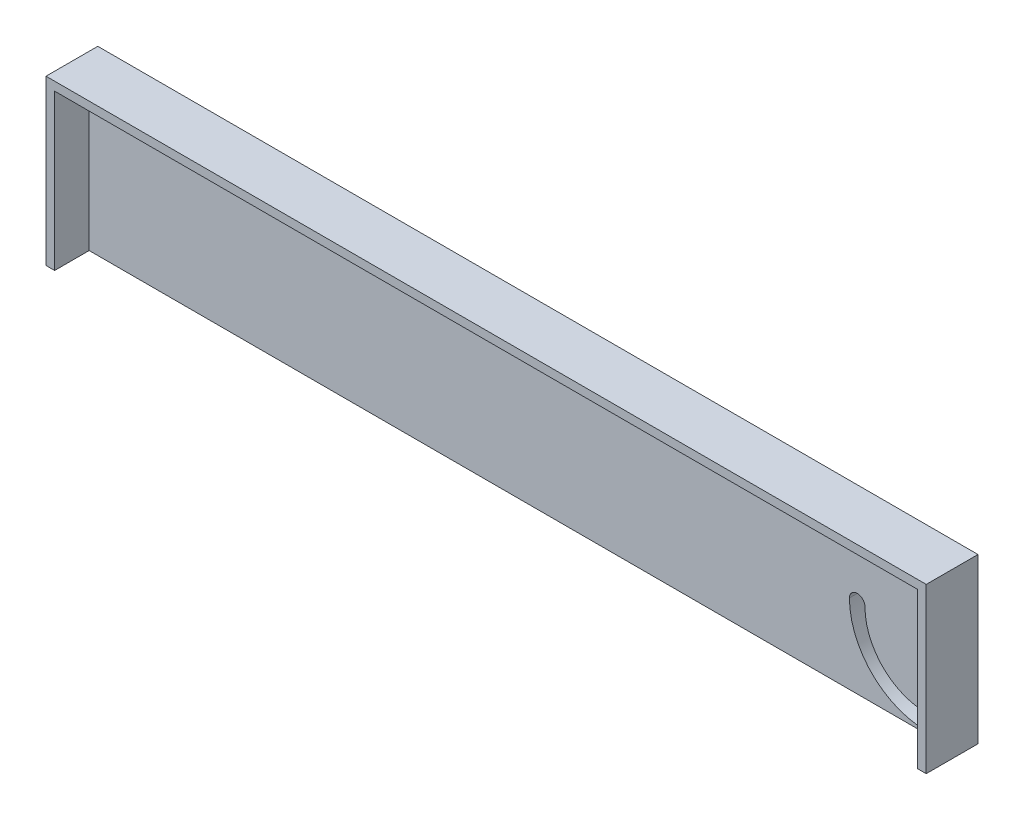
ISO-10303-21;
HEADER;
FILE_DESCRIPTION(('STEP AP214'),'2;1');
FILE_NAME('part.step','',(''),(''),'','','');
FILE_SCHEMA(('AUTOMOTIVE_DESIGN { 1 0 10303 214 1 1 1 1 }'));
ENDSEC;
DATA;
#1=APPLICATION_CONTEXT('core data for automotive mechanical design processes');
#2=APPLICATION_PROTOCOL_DEFINITION('international standard','automotive_design',2000,#1);
#3=PRODUCT_CONTEXT('',#1,'mechanical');
#4=PRODUCT('Part','Part','',(#3));
#5=PRODUCT_RELATED_PRODUCT_CATEGORY('part','',(#4));
#6=PRODUCT_DEFINITION_FORMATION('','',#4);
#7=PRODUCT_DEFINITION_CONTEXT('part definition',#1,'design');
#8=PRODUCT_DEFINITION('design','',#6,#7);
#9=PRODUCT_DEFINITION_SHAPE('','',#8);
#10=(LENGTH_UNIT() NAMED_UNIT(*) SI_UNIT(.MILLI.,.METRE.));
#11=(NAMED_UNIT(*) PLANE_ANGLE_UNIT() SI_UNIT($,.RADIAN.));
#12=(NAMED_UNIT(*) SI_UNIT($,.STERADIAN.) SOLID_ANGLE_UNIT());
#13=UNCERTAINTY_MEASURE_WITH_UNIT(LENGTH_MEASURE(1.E-05),#10,'distance_accuracy_value','');
#14=(GEOMETRIC_REPRESENTATION_CONTEXT(3) GLOBAL_UNCERTAINTY_ASSIGNED_CONTEXT((#13)) GLOBAL_UNIT_ASSIGNED_CONTEXT((#10,
#11,#12)) REPRESENTATION_CONTEXT('',''));
#15=CARTESIAN_POINT('',(0.,0.,0.));
#16=DIRECTION('',(0.,0.,1.));
#17=DIRECTION('',(1.,0.,0.));
#18=AXIS2_PLACEMENT_3D('',#15,#16,#17);
#19=CARTESIAN_POINT('',(0.,0.,0.));
#20=DIRECTION('',(0.,0.,1.));
#21=DIRECTION('',(1.,0.,0.));
#22=AXIS2_PLACEMENT_3D('',#19,#20,#21);
#23=PLANE('',#22);
#24=DIRECTION('',(0.,-1.,0.));
#25=VECTOR('',#24,1.);
#26=CARTESIAN_POINT('',(5.,0.,0.));
#27=LINE('',#26,#25);
#28=CARTESIAN_POINT('',(5.,-5.,0.));
#29=VERTEX_POINT('',#28);
#30=CARTESIAN_POINT('',(5.00000000000001,-95.,0.));
#31=VERTEX_POINT('',#30);
#32=EDGE_CURVE('E260',#29,#31,#27,.T.);
#33=ORIENTED_EDGE('',*,*,#32,.T.);
#34=DIRECTION('',(1.,0.,0.));
#35=VECTOR('',#34,1.);
#36=CARTESIAN_POINT('',(0.,-95.,0.));
#37=LINE('',#36,#35);
#38=CARTESIAN_POINT('',(505.,-95.,0.));
#39=VERTEX_POINT('',#38);
#40=EDGE_CURVE('E249',#31,#39,#37,.T.);
#41=ORIENTED_EDGE('',*,*,#40,.T.);
#42=DIRECTION('',(0.,-1.,0.));
#43=VECTOR('',#42,1.);
#44=CARTESIAN_POINT('',(505.,0.,0.));
#45=LINE('',#44,#43);
#46=CARTESIAN_POINT('',(505.,-5.,0.));
#47=VERTEX_POINT('',#46);
#48=EDGE_CURVE('E246',#47,#39,#45,.T.);
#49=ORIENTED_EDGE('',*,*,#48,.F.);
#50=DIRECTION('',(1.,0.,0.));
#51=VECTOR('',#50,1.);
#52=CARTESIAN_POINT('',(0.,-5.,0.));
#53=LINE('',#52,#51);
#54=EDGE_CURVE('E257',#29,#47,#53,.T.);
#55=ORIENTED_EDGE('',*,*,#54,.F.);
#56=EDGE_LOOP('',(#33,#41,#49,#55));
#57=FACE_BOUND('',#56,.T.);
#58=CARTESIAN_POINT('',(490.,-89.,0.));
#59=DIRECTION('',(0.,0.,1.));
#60=DIRECTION('',(1.,0.,0.));
#61=AXIS2_PLACEMENT_3D('',#58,#59,#60);
#62=CIRCLE('',#61,4.5);
#63=CARTESIAN_POINT('',(490.,-93.5,0.));
#64=VERTEX_POINT('',#63);
#65=CARTESIAN_POINT('',(490.,-84.5,0.));
#66=VERTEX_POINT('',#65);
#67=EDGE_CURVE('E92',#64,#66,#62,.T.);
#68=ORIENTED_EDGE('',*,*,#67,.F.);
#69=CARTESIAN_POINT('',(490.,-49.,0.));
#70=DIRECTION('',(0.,0.,1.));
#71=DIRECTION('',(1.,0.,0.));
#72=AXIS2_PLACEMENT_3D('',#69,#70,#71);
#73=CIRCLE('',#72,44.5);
#74=CARTESIAN_POINT('',(445.5,-49.,0.));
#75=VERTEX_POINT('',#74);
#76=EDGE_CURVE('E233',#64,#75,#73,.F.);
#77=ORIENTED_EDGE('',*,*,#76,.T.);
#78=CARTESIAN_POINT('',(450.,-49.,0.));
#79=DIRECTION('',(0.,0.,1.));
#80=DIRECTION('',(1.,0.,0.));
#81=AXIS2_PLACEMENT_3D('',#78,#79,#80);
#82=CIRCLE('',#81,4.5);
#83=CARTESIAN_POINT('',(454.5,-49.,0.));
#84=VERTEX_POINT('',#83);
#85=EDGE_CURVE('E224',#84,#75,#82,.T.);
#86=ORIENTED_EDGE('',*,*,#85,.F.);
#87=CARTESIAN_POINT('',(490.,-49.,0.));
#88=DIRECTION('',(0.,0.,1.));
#89=DIRECTION('',(1.,0.,0.));
#90=AXIS2_PLACEMENT_3D('',#87,#88,#89);
#91=CIRCLE('',#90,35.5);
#92=EDGE_CURVE('E293',#66,#84,#91,.F.);
#93=ORIENTED_EDGE('',*,*,#92,.F.);
#94=EDGE_LOOP('',(#68,#77,#86,#93));
#95=FACE_BOUND('',#94,.T.);
#96=CARTESIAN_POINT('',(490.,-49.,0.));
#97=DIRECTION('',(0.,0.,1.));
#98=DIRECTION('',(1.,0.,0.));
#99=AXIS2_PLACEMENT_3D('',#96,#97,#98);
#100=CIRCLE('',#99,4.50000000000002);
#101=CARTESIAN_POINT('',(494.5,-49.,0.));
#102=VERTEX_POINT('',#101);
#103=EDGE_CURVE('E289',#102,#102,#100,.T.);
#104=ORIENTED_EDGE('',*,*,#103,.F.);
#105=EDGE_LOOP('',(#104));
#106=FACE_BOUND('',#105,.T.);
#107=ADVANCED_FACE('F76',(#57,#95,#106),#23,.T.);
#108=CARTESIAN_POINT('',(0.,0.,-10.));
#109=DIRECTION('',(0.,0.,1.));
#110=DIRECTION('',(1.,0.,0.));
#111=AXIS2_PLACEMENT_3D('',#108,#109,#110);
#112=PLANE('',#111);
#113=CARTESIAN_POINT('',(490.,-49.,-10.));
#114=DIRECTION('',(0.,0.,1.));
#115=DIRECTION('',(1.,0.,0.));
#116=AXIS2_PLACEMENT_3D('',#113,#114,#115);
#117=CIRCLE('',#116,44.5);
#118=CARTESIAN_POINT('',(490.,-93.5,-10.));
#119=VERTEX_POINT('',#118);
#120=CARTESIAN_POINT('',(445.5,-49.,-10.));
#121=VERTEX_POINT('',#120);
#122=EDGE_CURVE('E85',#119,#121,#117,.F.);
#123=ORIENTED_EDGE('',*,*,#122,.F.);
#124=CARTESIAN_POINT('',(490.,-89.,-10.));
#125=DIRECTION('',(0.,0.,1.));
#126=DIRECTION('',(1.,0.,0.));
#127=AXIS2_PLACEMENT_3D('',#124,#125,#126);
#128=CIRCLE('',#127,4.5);
#129=CARTESIAN_POINT('',(490.,-84.5,-10.));
#130=VERTEX_POINT('',#129);
#131=EDGE_CURVE('E12',#119,#130,#128,.T.);
#132=ORIENTED_EDGE('',*,*,#131,.T.);
#133=CARTESIAN_POINT('',(490.,-49.,-10.));
#134=DIRECTION('',(0.,0.,1.));
#135=DIRECTION('',(1.,0.,0.));
#136=AXIS2_PLACEMENT_3D('',#133,#134,#135);
#137=CIRCLE('',#136,35.5);
#138=CARTESIAN_POINT('',(454.5,-49.,-10.));
#139=VERTEX_POINT('',#138);
#140=EDGE_CURVE('E205',#130,#139,#137,.F.);
#141=ORIENTED_EDGE('',*,*,#140,.T.);
#142=CARTESIAN_POINT('',(450.,-49.,-10.));
#143=DIRECTION('',(0.,0.,1.));
#144=DIRECTION('',(1.,0.,0.));
#145=AXIS2_PLACEMENT_3D('',#142,#143,#144);
#146=CIRCLE('',#145,4.5);
#147=EDGE_CURVE('E208',#139,#121,#146,.T.);
#148=ORIENTED_EDGE('',*,*,#147,.T.);
#149=EDGE_LOOP('',(#123,#132,#141,#148));
#150=FACE_BOUND('',#149,.T.);
#151=DIRECTION('',(0.,1.,0.));
#152=VECTOR('',#151,1.);
#153=CARTESIAN_POINT('',(510.,0.,-10.));
#154=LINE('',#153,#152);
#155=CARTESIAN_POINT('',(510.,-95.,-10.));
#156=VERTEX_POINT('',#155);
#157=CARTESIAN_POINT('',(510.,0.,-10.));
#158=VERTEX_POINT('',#157);
#159=EDGE_CURVE('E241',#156,#158,#154,.T.);
#160=ORIENTED_EDGE('',*,*,#159,.F.);
#161=DIRECTION('',(-1.,0.,0.));
#162=VECTOR('',#161,1.);
#163=CARTESIAN_POINT('',(0.,-95.,-10.));
#164=LINE('',#163,#162);
#165=CARTESIAN_POINT('',(0.,-95.,-10.));
#166=VERTEX_POINT('',#165);
#167=EDGE_CURVE('E172',#156,#166,#164,.T.);
#168=ORIENTED_EDGE('',*,*,#167,.T.);
#169=DIRECTION('',(0.,-1.,0.));
#170=VECTOR('',#169,1.);
#171=CARTESIAN_POINT('',(0.,0.,-10.));
#172=LINE('',#171,#170);
#173=CARTESIAN_POINT('',(0.,0.,-10.));
#174=VERTEX_POINT('',#173);
#175=EDGE_CURVE('E238',#174,#166,#172,.T.);
#176=ORIENTED_EDGE('',*,*,#175,.F.);
#177=DIRECTION('',(-1.,0.,0.));
#178=VECTOR('',#177,1.);
#179=CARTESIAN_POINT('',(0.,0.,-10.));
#180=LINE('',#179,#178);
#181=EDGE_CURVE('E243',#158,#174,#180,.T.);
#182=ORIENTED_EDGE('',*,*,#181,.F.);
#183=EDGE_LOOP('',(#160,#168,#176,#182));
#184=FACE_BOUND('',#183,.T.);
#185=CARTESIAN_POINT('',(490.,-49.,-10.));
#186=DIRECTION('',(0.,0.,1.));
#187=DIRECTION('',(1.,0.,0.));
#188=AXIS2_PLACEMENT_3D('',#185,#186,#187);
#189=CIRCLE('',#188,4.50000000000002);
#190=CARTESIAN_POINT('',(494.5,-49.,-10.));
#191=VERTEX_POINT('',#190);
#192=EDGE_CURVE('E80',#191,#191,#189,.T.);
#193=ORIENTED_EDGE('',*,*,#192,.T.);
#194=EDGE_LOOP('',(#193));
#195=FACE_BOUND('',#194,.T.);
#196=ADVANCED_FACE('F227',(#150,#184,#195),#112,.F.);
#197=CARTESIAN_POINT('',(0.,0.,20.));
#198=DIRECTION('',(1.,0.,0.));
#199=DIRECTION('',(0.,1.,0.));
#200=AXIS2_PLACEMENT_3D('',#197,#198,#199);
#201=PLANE('',#200);
#202=ORIENTED_EDGE('',*,*,#175,.T.);
#203=DIRECTION('',(0.,0.,1.));
#204=VECTOR('',#203,1.);
#205=CARTESIAN_POINT('',(0.,-95.,-20.));
#206=LINE('',#205,#204);
#207=CARTESIAN_POINT('',(0.,-95.,20.));
#208=VERTEX_POINT('',#207);
#209=EDGE_CURVE('E176',#166,#208,#206,.T.);
#210=ORIENTED_EDGE('',*,*,#209,.T.);
#211=DIRECTION('',(0.,-1.,0.));
#212=VECTOR('',#211,1.);
#213=CARTESIAN_POINT('',(0.,0.,20.));
#214=LINE('',#213,#212);
#215=CARTESIAN_POINT('',(0.,0.,20.));
#216=VERTEX_POINT('',#215);
#217=EDGE_CURVE('E194',#216,#208,#214,.T.);
#218=ORIENTED_EDGE('',*,*,#217,.F.);
#219=DIRECTION('',(0.,0.,-1.));
#220=VECTOR('',#219,1.);
#221=CARTESIAN_POINT('',(0.,0.,20.));
#222=LINE('',#221,#220);
#223=EDGE_CURVE('E196',#216,#174,#222,.T.);
#224=ORIENTED_EDGE('',*,*,#223,.T.);
#225=EDGE_LOOP('',(#202,#210,#218,#224));
#226=FACE_BOUND('',#225,.T.);
#227=ADVANCED_FACE('F78',(#226),#201,.F.);
#228=CARTESIAN_POINT('',(510.,0.,20.));
#229=DIRECTION('',(1.,0.,0.));
#230=DIRECTION('',(0.,1.,0.));
#231=AXIS2_PLACEMENT_3D('',#228,#229,#230);
#232=PLANE('',#231);
#233=DIRECTION('',(0.,0.,1.));
#234=VECTOR('',#233,1.);
#235=CARTESIAN_POINT('',(510.,-95.,-20.));
#236=LINE('',#235,#234);
#237=CARTESIAN_POINT('',(510.,-95.,20.));
#238=VERTEX_POINT('',#237);
#239=EDGE_CURVE('E166',#156,#238,#236,.T.);
#240=ORIENTED_EDGE('',*,*,#239,.F.);
#241=ORIENTED_EDGE('',*,*,#159,.T.);
#242=DIRECTION('',(0.,0.,-1.));
#243=VECTOR('',#242,1.);
#244=CARTESIAN_POINT('',(510.,0.,20.));
#245=LINE('',#244,#243);
#246=CARTESIAN_POINT('',(510.,0.,20.));
#247=VERTEX_POINT('',#246);
#248=EDGE_CURVE('E192',#247,#158,#245,.T.);
#249=ORIENTED_EDGE('',*,*,#248,.F.);
#250=DIRECTION('',(0.,-1.,0.));
#251=VECTOR('',#250,1.);
#252=CARTESIAN_POINT('',(510.,0.,20.));
#253=LINE('',#252,#251);
#254=EDGE_CURVE('E183',#247,#238,#253,.T.);
#255=ORIENTED_EDGE('',*,*,#254,.T.);
#256=EDGE_LOOP('',(#240,#241,#249,#255));
#257=FACE_BOUND('',#256,.T.);
#258=ADVANCED_FACE('F190',(#257),#232,.T.);
#259=CARTESIAN_POINT('',(0.,0.,20.));
#260=DIRECTION('',(0.,1.,0.));
#261=DIRECTION('',(0.,0.,1.));
#262=AXIS2_PLACEMENT_3D('',#259,#260,#261);
#263=PLANE('',#262);
#264=ORIENTED_EDGE('',*,*,#248,.T.);
#265=ORIENTED_EDGE('',*,*,#181,.T.);
#266=ORIENTED_EDGE('',*,*,#223,.F.);
#267=DIRECTION('',(1.,0.,0.));
#268=VECTOR('',#267,1.);
#269=CARTESIAN_POINT('',(0.,0.,20.));
#270=LINE('',#269,#268);
#271=EDGE_CURVE('E193',#216,#247,#270,.T.);
#272=ORIENTED_EDGE('',*,*,#271,.T.);
#273=EDGE_LOOP('',(#264,#265,#266,#272));
#274=FACE_BOUND('',#273,.T.);
#275=ADVANCED_FACE('F327',(#274),#263,.T.);
#276=CARTESIAN_POINT('',(0.,0.,20.));
#277=DIRECTION('',(0.,0.,1.));
#278=DIRECTION('',(1.,0.,0.));
#279=AXIS2_PLACEMENT_3D('',#276,#277,#278);
#280=PLANE('',#279);
#281=DIRECTION('',(-1.,0.,0.));
#282=VECTOR('',#281,1.);
#283=CARTESIAN_POINT('',(0.,-95.,20.));
#284=LINE('',#283,#282);
#285=CARTESIAN_POINT('',(505.,-95.,20.));
#286=VERTEX_POINT('',#285);
#287=EDGE_CURVE('E169',#238,#286,#284,.T.);
#288=ORIENTED_EDGE('',*,*,#287,.F.);
#289=ORIENTED_EDGE('',*,*,#254,.F.);
#290=ORIENTED_EDGE('',*,*,#271,.F.);
#291=ORIENTED_EDGE('',*,*,#217,.T.);
#292=CARTESIAN_POINT('',(5.00000000000001,-95.,20.));
#293=VERTEX_POINT('',#292);
#294=EDGE_CURVE('E188',#293,#208,#284,.T.);
#295=ORIENTED_EDGE('',*,*,#294,.F.);
#296=DIRECTION('',(0.,-1.,0.));
#297=VECTOR('',#296,1.);
#298=CARTESIAN_POINT('',(5.,0.,20.));
#299=LINE('',#298,#297);
#300=CARTESIAN_POINT('',(5.,-5.,20.));
#301=VERTEX_POINT('',#300);
#302=EDGE_CURVE('E251',#301,#293,#299,.T.);
#303=ORIENTED_EDGE('',*,*,#302,.F.);
#304=DIRECTION('',(1.,0.,0.));
#305=VECTOR('',#304,1.);
#306=CARTESIAN_POINT('',(0.,-5.,20.));
#307=LINE('',#306,#305);
#308=CARTESIAN_POINT('',(505.,-5.,20.));
#309=VERTEX_POINT('',#308);
#310=EDGE_CURVE('E248',#301,#309,#307,.T.);
#311=ORIENTED_EDGE('',*,*,#310,.T.);
#312=DIRECTION('',(0.,-1.,0.));
#313=VECTOR('',#312,1.);
#314=CARTESIAN_POINT('',(505.,0.,20.));
#315=LINE('',#314,#313);
#316=EDGE_CURVE('E187',#309,#286,#315,.T.);
#317=ORIENTED_EDGE('',*,*,#316,.T.);
#318=EDGE_LOOP('',(#288,#289,#290,#291,#295,#303,#311,#317));
#319=FACE_BOUND('',#318,.T.);
#320=ADVANCED_FACE('F181',(#319),#280,.T.);
#321=CARTESIAN_POINT('',(505.,0.,20.));
#322=DIRECTION('',(1.,0.,0.));
#323=DIRECTION('',(0.,0.,-1.));
#324=AXIS2_PLACEMENT_3D('',#321,#322,#323);
#325=PLANE('',#324);
#326=ORIENTED_EDGE('',*,*,#48,.T.);
#327=DIRECTION('',(0.,0.,-1.));
#328=VECTOR('',#327,1.);
#329=CARTESIAN_POINT('',(505.,-95.,20.));
#330=LINE('',#329,#328);
#331=EDGE_CURVE('E254',#286,#39,#330,.T.);
#332=ORIENTED_EDGE('',*,*,#331,.F.);
#333=ORIENTED_EDGE('',*,*,#316,.F.);
#334=DIRECTION('',(0.,0.,-1.));
#335=VECTOR('',#334,1.);
#336=CARTESIAN_POINT('',(505.,-5.,20.));
#337=LINE('',#336,#335);
#338=EDGE_CURVE('E199',#309,#47,#337,.T.);
#339=ORIENTED_EDGE('',*,*,#338,.T.);
#340=EDGE_LOOP('',(#326,#332,#333,#339));
#341=FACE_BOUND('',#340,.T.);
#342=ADVANCED_FACE('F271',(#341),#325,.F.);
#343=CARTESIAN_POINT('',(0.,-5.,20.));
#344=DIRECTION('',(0.,1.,0.));
#345=DIRECTION('',(0.,0.,1.));
#346=AXIS2_PLACEMENT_3D('',#343,#344,#345);
#347=PLANE('',#346);
#348=ORIENTED_EDGE('',*,*,#54,.T.);
#349=ORIENTED_EDGE('',*,*,#338,.F.);
#350=ORIENTED_EDGE('',*,*,#310,.F.);
#351=DIRECTION('',(0.,0.,-1.));
#352=VECTOR('',#351,1.);
#353=CARTESIAN_POINT('',(5.,-5.,20.));
#354=LINE('',#353,#352);
#355=EDGE_CURVE('E269',#301,#29,#354,.T.);
#356=ORIENTED_EDGE('',*,*,#355,.T.);
#357=EDGE_LOOP('',(#348,#349,#350,#356));
#358=FACE_BOUND('',#357,.T.);
#359=ADVANCED_FACE('F276',(#358),#347,.F.);
#360=CARTESIAN_POINT('',(5.,0.,20.));
#361=DIRECTION('',(1.,0.,0.));
#362=DIRECTION('',(0.,1.,0.));
#363=AXIS2_PLACEMENT_3D('',#360,#361,#362);
#364=PLANE('',#363);
#365=ORIENTED_EDGE('',*,*,#32,.F.);
#366=ORIENTED_EDGE('',*,*,#355,.F.);
#367=ORIENTED_EDGE('',*,*,#302,.T.);
#368=DIRECTION('',(0.,0.,-1.));
#369=VECTOR('',#368,1.);
#370=CARTESIAN_POINT('',(5.00000000000001,-95.,20.));
#371=LINE('',#370,#369);
#372=EDGE_CURVE('E266',#293,#31,#371,.T.);
#373=ORIENTED_EDGE('',*,*,#372,.T.);
#374=EDGE_LOOP('',(#365,#366,#367,#373));
#375=FACE_BOUND('',#374,.T.);
#376=ADVANCED_FACE('F282',(#375),#364,.T.);
#377=CARTESIAN_POINT('',(490.,-89.,-1070.));
#378=DIRECTION('',(0.,0.,1.));
#379=DIRECTION('',(1.,0.,0.));
#380=AXIS2_PLACEMENT_3D('',#377,#378,#379);
#381=CYLINDRICAL_SURFACE('',#380,4.5);
#382=DIRECTION('',(0.,0.,1.));
#383=VECTOR('',#382,1.);
#384=CARTESIAN_POINT('',(490.,-93.5,-1070.));
#385=LINE('',#384,#383);
#386=EDGE_CURVE('E219',#119,#64,#385,.T.);
#387=ORIENTED_EDGE('',*,*,#386,.T.);
#388=ORIENTED_EDGE('',*,*,#67,.T.);
#389=DIRECTION('',(0.,0.,1.));
#390=VECTOR('',#389,1.);
#391=CARTESIAN_POINT('',(490.,-84.5,-1070.));
#392=LINE('',#391,#390);
#393=EDGE_CURVE('E230',#130,#66,#392,.T.);
#394=ORIENTED_EDGE('',*,*,#393,.F.);
#395=ORIENTED_EDGE('',*,*,#131,.F.);
#396=EDGE_LOOP('',(#387,#388,#394,#395));
#397=FACE_BOUND('',#396,.T.);
#398=ADVANCED_FACE('F232',(#397),#381,.F.);
#399=CARTESIAN_POINT('',(490.,-49.,-1070.));
#400=DIRECTION('',(0.,0.,1.));
#401=DIRECTION('',(1.,0.,0.));
#402=AXIS2_PLACEMENT_3D('',#399,#400,#401);
#403=CYLINDRICAL_SURFACE('',#402,44.5);
#404=ORIENTED_EDGE('',*,*,#122,.T.);
#405=DIRECTION('',(0.,0.,1.));
#406=VECTOR('',#405,1.);
#407=CARTESIAN_POINT('',(445.5,-49.,-1070.));
#408=LINE('',#407,#406);
#409=EDGE_CURVE('E217',#121,#75,#408,.T.);
#410=ORIENTED_EDGE('',*,*,#409,.T.);
#411=ORIENTED_EDGE('',*,*,#76,.F.);
#412=ORIENTED_EDGE('',*,*,#386,.F.);
#413=EDGE_LOOP('',(#404,#410,#411,#412));
#414=FACE_BOUND('',#413,.T.);
#415=ADVANCED_FACE('F215',(#414),#403,.F.);
#416=CARTESIAN_POINT('',(450.,-49.,-1070.));
#417=DIRECTION('',(0.,0.,1.));
#418=DIRECTION('',(1.,0.,0.));
#419=AXIS2_PLACEMENT_3D('',#416,#417,#418);
#420=CYLINDRICAL_SURFACE('',#419,4.5);
#421=DIRECTION('',(0.,0.,1.));
#422=VECTOR('',#421,1.);
#423=CARTESIAN_POINT('',(454.5,-49.,-1070.));
#424=LINE('',#423,#422);
#425=EDGE_CURVE('E100',#139,#84,#424,.T.);
#426=ORIENTED_EDGE('',*,*,#425,.T.);
#427=ORIENTED_EDGE('',*,*,#85,.T.);
#428=ORIENTED_EDGE('',*,*,#409,.F.);
#429=ORIENTED_EDGE('',*,*,#147,.F.);
#430=EDGE_LOOP('',(#426,#427,#428,#429));
#431=FACE_BOUND('',#430,.T.);
#432=ADVANCED_FACE('F222',(#431),#420,.F.);
#433=CARTESIAN_POINT('',(490.,-49.,-1070.));
#434=DIRECTION('',(0.,0.,1.));
#435=DIRECTION('',(1.,0.,0.));
#436=AXIS2_PLACEMENT_3D('',#433,#434,#435);
#437=CYLINDRICAL_SURFACE('',#436,35.5);
#438=ORIENTED_EDGE('',*,*,#393,.T.);
#439=ORIENTED_EDGE('',*,*,#92,.T.);
#440=ORIENTED_EDGE('',*,*,#425,.F.);
#441=ORIENTED_EDGE('',*,*,#140,.F.);
#442=EDGE_LOOP('',(#438,#439,#440,#441));
#443=FACE_BOUND('',#442,.T.);
#444=ADVANCED_FACE('F229',(#443),#437,.T.);
#445=CARTESIAN_POINT('',(490.,-49.,-1070.));
#446=DIRECTION('',(0.,0.,1.));
#447=DIRECTION('',(1.,0.,0.));
#448=AXIS2_PLACEMENT_3D('',#445,#446,#447);
#449=CYLINDRICAL_SURFACE('',#448,4.50000000000002);
#450=ORIENTED_EDGE('',*,*,#103,.T.);
#451=EDGE_LOOP('',(#450));
#452=FACE_BOUND('',#451,.T.);
#453=ORIENTED_EDGE('',*,*,#192,.F.);
#454=EDGE_LOOP('',(#453));
#455=FACE_BOUND('',#454,.T.);
#456=ADVANCED_FACE('F300',(#452,#455),#449,.F.);
#457=CARTESIAN_POINT('',(0.,-95.,-20.));
#458=DIRECTION('',(0.,1.,0.));
#459=DIRECTION('',(0.,0.,1.));
#460=AXIS2_PLACEMENT_3D('',#457,#458,#459);
#461=PLANE('',#460);
#462=ORIENTED_EDGE('',*,*,#239,.T.);
#463=ORIENTED_EDGE('',*,*,#287,.T.);
#464=ORIENTED_EDGE('',*,*,#331,.T.);
#465=ORIENTED_EDGE('',*,*,#40,.F.);
#466=ORIENTED_EDGE('',*,*,#372,.F.);
#467=ORIENTED_EDGE('',*,*,#294,.T.);
#468=ORIENTED_EDGE('',*,*,#209,.F.);
#469=ORIENTED_EDGE('',*,*,#167,.F.);
#470=EDGE_LOOP('',(#462,#463,#464,#465,#466,#467,#468,#469));
#471=FACE_BOUND('',#470,.T.);
#472=ADVANCED_FACE('F168',(#471),#461,.F.);
#473=CLOSED_SHELL('',(#107,#196,#227,#258,#275,#320,#342,#359,#376,#398,#415,#432,#444,#456,#472));
#474=MANIFOLD_SOLID_BREP('B2',#473);
#475=ADVANCED_BREP_SHAPE_REPRESENTATION('',(#18,#474),#14);
#476=SHAPE_DEFINITION_REPRESENTATION(#9,#475);
ENDSEC;
END-ISO-10303-21;
